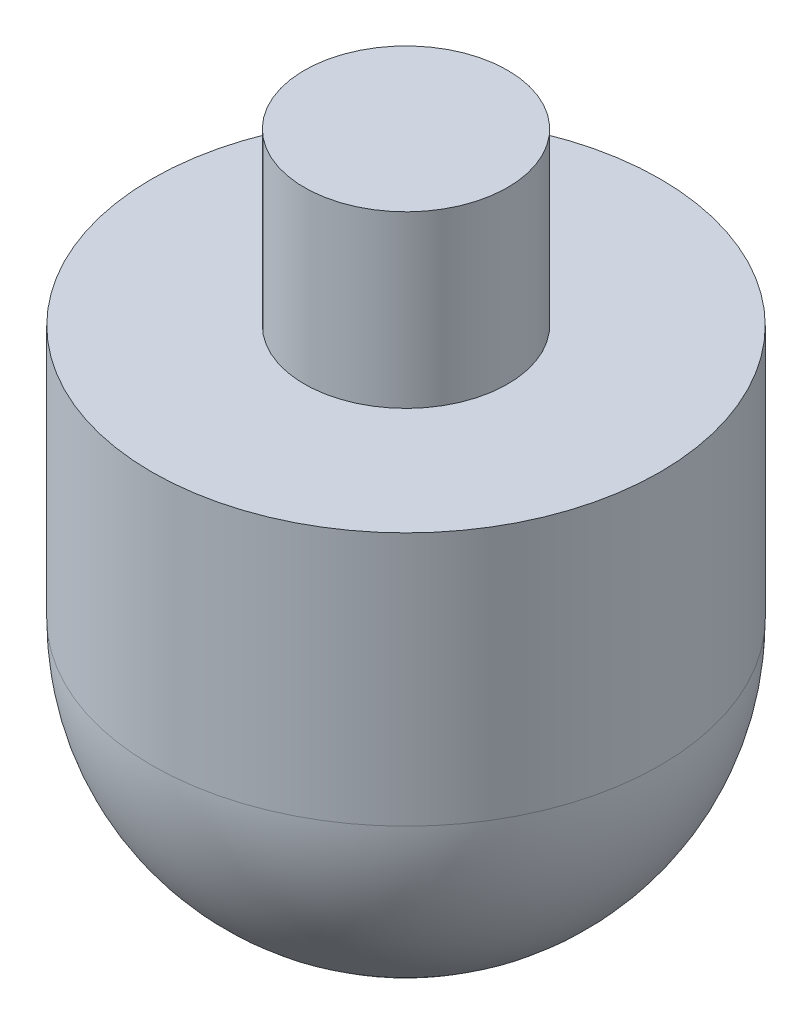
ISO-10303-21;
HEADER;
FILE_DESCRIPTION(('STEP AP214'),'2;1');
FILE_NAME('part.step','',(''),(''),'','','');
FILE_SCHEMA(('AUTOMOTIVE_DESIGN { 1 0 10303 214 1 1 1 1 }'));
ENDSEC;
DATA;
#1=APPLICATION_CONTEXT('core data for automotive mechanical design processes');
#2=APPLICATION_PROTOCOL_DEFINITION('international standard','automotive_design',2000,#1);
#3=PRODUCT_CONTEXT('',#1,'mechanical');
#4=PRODUCT('Part','Part','',(#3));
#5=PRODUCT_RELATED_PRODUCT_CATEGORY('part','',(#4));
#6=PRODUCT_DEFINITION_FORMATION('','',#4);
#7=PRODUCT_DEFINITION_CONTEXT('part definition',#1,'design');
#8=PRODUCT_DEFINITION('design','',#6,#7);
#9=PRODUCT_DEFINITION_SHAPE('','',#8);
#10=(LENGTH_UNIT() NAMED_UNIT(*) SI_UNIT(.MILLI.,.METRE.));
#11=(NAMED_UNIT(*) PLANE_ANGLE_UNIT() SI_UNIT($,.RADIAN.));
#12=(NAMED_UNIT(*) SI_UNIT($,.STERADIAN.) SOLID_ANGLE_UNIT());
#13=UNCERTAINTY_MEASURE_WITH_UNIT(LENGTH_MEASURE(1.E-05),#10,'distance_accuracy_value','');
#14=(GEOMETRIC_REPRESENTATION_CONTEXT(3) GLOBAL_UNCERTAINTY_ASSIGNED_CONTEXT((#13)) GLOBAL_UNIT_ASSIGNED_CONTEXT((#10,
#11,#12)) REPRESENTATION_CONTEXT('',''));
#15=CARTESIAN_POINT('',(0.,0.,0.));
#16=DIRECTION('',(0.,0.,1.));
#17=DIRECTION('',(1.,0.,0.));
#18=AXIS2_PLACEMENT_3D('',#15,#16,#17);
#19=CARTESIAN_POINT('',(60.,250.529628205385,0.));
#20=DIRECTION('',(0.,1.,0.));
#21=DIRECTION('',(0.,0.,1.));
#22=AXIS2_PLACEMENT_3D('',#19,#20,#21);
#23=PLANE('',#22);
#24=CARTESIAN_POINT('',(0.,250.529628205385,0.));
#25=DIRECTION('',(0.,-1.,0.));
#26=DIRECTION('',(0.,0.,-1.));
#27=AXIS2_PLACEMENT_3D('',#24,#25,#26);
#28=CIRCLE('',#27,60.);
#29=CARTESIAN_POINT('',(0.,250.529628205385,-60.));
#30=VERTEX_POINT('',#29);
#31=EDGE_CURVE('E45',#30,#30,#28,.T.);
#32=ORIENTED_EDGE('',*,*,#31,.F.);
#33=EDGE_LOOP('',(#32));
#34=FACE_BOUND('',#33,.T.);
#35=ADVANCED_FACE('F31',(#34),#23,.T.);
#36=CARTESIAN_POINT('',(0.,0.,0.));
#37=DIRECTION('',(0.,-1.,0.));
#38=DIRECTION('',(-1.,0.,0.));
#39=AXIS2_PLACEMENT_3D('',#36,#37,#38);
#40=SPHERICAL_SURFACE('',#39,150.);
#41=CARTESIAN_POINT('',(0.,0.,0.));
#42=DIRECTION('',(0.,-1.,0.));
#43=DIRECTION('',(0.,0.,-1.));
#44=AXIS2_PLACEMENT_3D('',#41,#42,#43);
#45=CIRCLE('',#44,150.);
#46=CARTESIAN_POINT('',(0.,0.,-150.));
#47=VERTEX_POINT('',#46);
#48=EDGE_CURVE('E10',#47,#47,#45,.T.);
#49=ORIENTED_EDGE('',*,*,#48,.T.);
#50=EDGE_LOOP('',(#49));
#51=FACE_BOUND('',#50,.T.);
#52=ADVANCED_FACE('F55',(#51),#40,.T.);
#53=CARTESIAN_POINT('',(0.,0.,0.));
#54=DIRECTION('',(0.,-1.,0.));
#55=DIRECTION('',(0.,0.,-1.));
#56=AXIS2_PLACEMENT_3D('',#53,#54,#55);
#57=CYLINDRICAL_SURFACE('',#56,150.);
#58=CARTESIAN_POINT('',(0.,150.,0.));
#59=DIRECTION('',(0.,-1.,0.));
#60=DIRECTION('',(0.,0.,-1.));
#61=AXIS2_PLACEMENT_3D('',#58,#59,#60);
#62=CIRCLE('',#61,150.);
#63=CARTESIAN_POINT('',(0.,150.,-150.));
#64=VERTEX_POINT('',#63);
#65=EDGE_CURVE('E37',#64,#64,#62,.T.);
#66=ORIENTED_EDGE('',*,*,#65,.T.);
#67=EDGE_LOOP('',(#66));
#68=FACE_BOUND('',#67,.T.);
#69=ORIENTED_EDGE('',*,*,#48,.F.);
#70=EDGE_LOOP('',(#69));
#71=FACE_BOUND('',#70,.T.);
#72=ADVANCED_FACE('F59',(#68,#71),#57,.T.);
#73=CARTESIAN_POINT('',(150.,150.,0.));
#74=DIRECTION('',(0.,1.,0.));
#75=DIRECTION('',(0.,0.,1.));
#76=AXIS2_PLACEMENT_3D('',#73,#74,#75);
#77=PLANE('',#76);
#78=CARTESIAN_POINT('',(0.,150.,0.));
#79=DIRECTION('',(0.,-1.,0.));
#80=DIRECTION('',(0.,0.,-1.));
#81=AXIS2_PLACEMENT_3D('',#78,#79,#80);
#82=CIRCLE('',#81,60.);
#83=CARTESIAN_POINT('',(0.,150.,-60.));
#84=VERTEX_POINT('',#83);
#85=EDGE_CURVE('E41',#84,#84,#82,.T.);
#86=ORIENTED_EDGE('',*,*,#85,.T.);
#87=EDGE_LOOP('',(#86));
#88=FACE_BOUND('',#87,.T.);
#89=ORIENTED_EDGE('',*,*,#65,.F.);
#90=EDGE_LOOP('',(#89));
#91=FACE_BOUND('',#90,.T.);
#92=ADVANCED_FACE('F63',(#88,#91),#77,.T.);
#93=CARTESIAN_POINT('',(0.,0.,0.));
#94=DIRECTION('',(0.,-1.,0.));
#95=DIRECTION('',(0.,0.,-1.));
#96=AXIS2_PLACEMENT_3D('',#93,#94,#95);
#97=CYLINDRICAL_SURFACE('',#96,60.);
#98=ORIENTED_EDGE('',*,*,#31,.T.);
#99=EDGE_LOOP('',(#98));
#100=FACE_BOUND('',#99,.T.);
#101=ORIENTED_EDGE('',*,*,#85,.F.);
#102=EDGE_LOOP('',(#101));
#103=FACE_BOUND('',#102,.T.);
#104=ADVANCED_FACE('F51',(#100,#103),#97,.T.);
#105=CLOSED_SHELL('',(#35,#52,#72,#92,#104));
#106=MANIFOLD_SOLID_BREP('B2',#105);
#107=ADVANCED_BREP_SHAPE_REPRESENTATION('',(#18,#106),#14);
#108=SHAPE_DEFINITION_REPRESENTATION(#9,#107);
ENDSEC;
END-ISO-10303-21;
